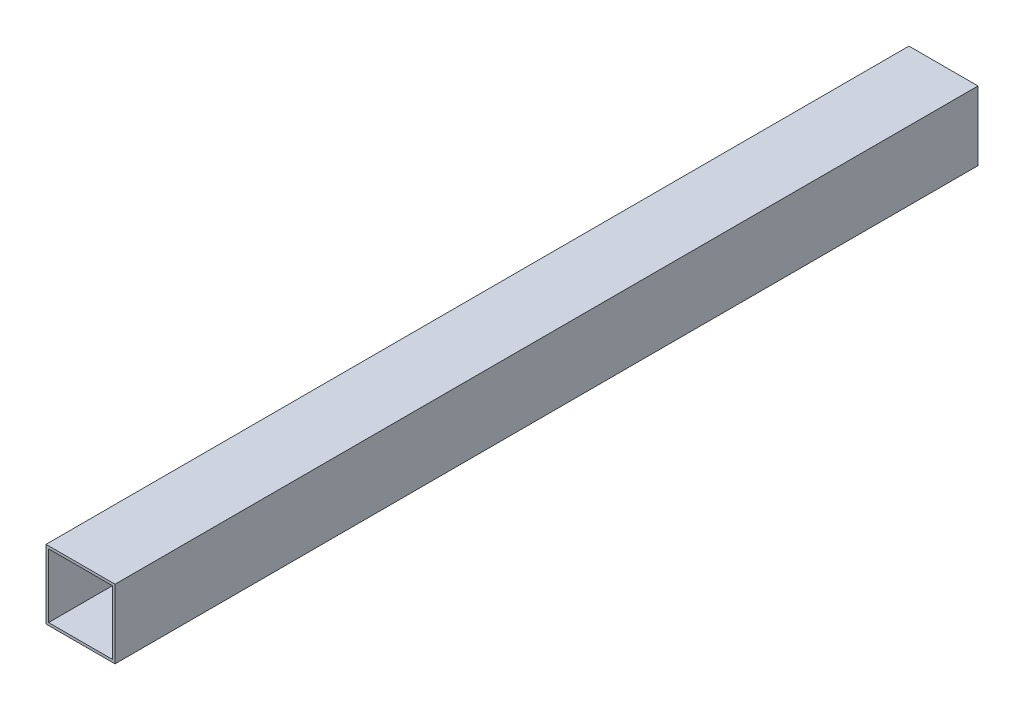
ISO-10303-21;
HEADER;
FILE_DESCRIPTION(('STEP AP214'),'2;1');
FILE_NAME('part.step','',(''),(''),'','','');
FILE_SCHEMA(('AUTOMOTIVE_DESIGN { 1 0 10303 214 1 1 1 1 }'));
ENDSEC;
DATA;
#1=APPLICATION_CONTEXT('core data for automotive mechanical design processes');
#2=APPLICATION_PROTOCOL_DEFINITION('international standard','automotive_design',2000,#1);
#3=PRODUCT_CONTEXT('',#1,'mechanical');
#4=PRODUCT('Part','Part','',(#3));
#5=PRODUCT_RELATED_PRODUCT_CATEGORY('part','',(#4));
#6=PRODUCT_DEFINITION_FORMATION('','',#4);
#7=PRODUCT_DEFINITION_CONTEXT('part definition',#1,'design');
#8=PRODUCT_DEFINITION('design','',#6,#7);
#9=PRODUCT_DEFINITION_SHAPE('','',#8);
#10=(LENGTH_UNIT() NAMED_UNIT(*) SI_UNIT(.MILLI.,.METRE.));
#11=(NAMED_UNIT(*) PLANE_ANGLE_UNIT() SI_UNIT($,.RADIAN.));
#12=(NAMED_UNIT(*) SI_UNIT($,.STERADIAN.) SOLID_ANGLE_UNIT());
#13=UNCERTAINTY_MEASURE_WITH_UNIT(LENGTH_MEASURE(1.E-05),#10,'distance_accuracy_value','');
#14=(GEOMETRIC_REPRESENTATION_CONTEXT(3) GLOBAL_UNCERTAINTY_ASSIGNED_CONTEXT((#13)) GLOBAL_UNIT_ASSIGNED_CONTEXT((#10,
#11,#12)) REPRESENTATION_CONTEXT('',''));
#15=CARTESIAN_POINT('',(0.,0.,0.));
#16=DIRECTION('',(0.,0.,1.));
#17=DIRECTION('',(1.,0.,0.));
#18=AXIS2_PLACEMENT_3D('',#15,#16,#17);
#19=CARTESIAN_POINT('',(0.,0.,500.));
#20=DIRECTION('',(0.,0.,-1.));
#21=DIRECTION('',(-1.,0.,0.));
#22=AXIS2_PLACEMENT_3D('',#19,#20,#21);
#23=PLANE('',#22);
#24=DIRECTION('',(0.,1.,0.));
#25=VECTOR('',#24,1.);
#26=CARTESIAN_POINT('',(20.,-20.,500.));
#27=LINE('',#26,#25);
#28=CARTESIAN_POINT('',(20.,-20.,500.));
#29=VERTEX_POINT('',#28);
#30=CARTESIAN_POINT('',(20.,20.,500.));
#31=VERTEX_POINT('',#30);
#32=EDGE_CURVE('E134',#29,#31,#27,.T.);
#33=ORIENTED_EDGE('',*,*,#32,.T.);
#34=DIRECTION('',(-1.,0.,0.));
#35=VECTOR('',#34,1.);
#36=CARTESIAN_POINT('',(-20.,20.,500.));
#37=LINE('',#36,#35);
#38=CARTESIAN_POINT('',(-20.,20.,500.));
#39=VERTEX_POINT('',#38);
#40=EDGE_CURVE('E137',#31,#39,#37,.T.);
#41=ORIENTED_EDGE('',*,*,#40,.T.);
#42=DIRECTION('',(0.,-1.,0.));
#43=VECTOR('',#42,1.);
#44=CARTESIAN_POINT('',(-20.,-20.,500.));
#45=LINE('',#44,#43);
#46=CARTESIAN_POINT('',(-20.,-20.,500.));
#47=VERTEX_POINT('',#46);
#48=EDGE_CURVE('E140',#39,#47,#45,.T.);
#49=ORIENTED_EDGE('',*,*,#48,.T.);
#50=DIRECTION('',(1.,0.,0.));
#51=VECTOR('',#50,1.);
#52=CARTESIAN_POINT('',(-20.,-20.,500.));
#53=LINE('',#52,#51);
#54=EDGE_CURVE('E142',#47,#29,#53,.T.);
#55=ORIENTED_EDGE('',*,*,#54,.T.);
#56=EDGE_LOOP('',(#33,#41,#49,#55));
#57=FACE_BOUND('',#56,.T.);
#58=DIRECTION('',(0.,1.,0.));
#59=VECTOR('',#58,1.);
#60=CARTESIAN_POINT('',(18.5,-18.5,500.));
#61=LINE('',#60,#59);
#62=CARTESIAN_POINT('',(18.5,-18.5,500.));
#63=VERTEX_POINT('',#62);
#64=CARTESIAN_POINT('',(18.5,18.5,500.));
#65=VERTEX_POINT('',#64);
#66=EDGE_CURVE('E98',#63,#65,#61,.T.);
#67=ORIENTED_EDGE('',*,*,#66,.F.);
#68=DIRECTION('',(1.,0.,0.));
#69=VECTOR('',#68,1.);
#70=CARTESIAN_POINT('',(-18.5,-18.5,500.));
#71=LINE('',#70,#69);
#72=CARTESIAN_POINT('',(-18.5,-18.5,500.));
#73=VERTEX_POINT('',#72);
#74=EDGE_CURVE('E120',#73,#63,#71,.T.);
#75=ORIENTED_EDGE('',*,*,#74,.F.);
#76=DIRECTION('',(0.,-1.,0.));
#77=VECTOR('',#76,1.);
#78=CARTESIAN_POINT('',(-18.5,-18.5,500.));
#79=LINE('',#78,#77);
#80=CARTESIAN_POINT('',(-18.5,18.5,500.));
#81=VERTEX_POINT('',#80);
#82=EDGE_CURVE('E118',#81,#73,#79,.T.);
#83=ORIENTED_EDGE('',*,*,#82,.F.);
#84=DIRECTION('',(-1.,0.,0.));
#85=VECTOR('',#84,1.);
#86=CARTESIAN_POINT('',(-18.5,18.5,500.));
#87=LINE('',#86,#85);
#88=EDGE_CURVE('E106',#65,#81,#87,.T.);
#89=ORIENTED_EDGE('',*,*,#88,.F.);
#90=EDGE_LOOP('',(#67,#75,#83,#89));
#91=FACE_BOUND('',#90,.T.);
#92=ADVANCED_FACE('F33',(#57,#91),#23,.F.);
#93=CARTESIAN_POINT('',(0.,0.,0.));
#94=DIRECTION('',(0.,0.,-1.));
#95=DIRECTION('',(-1.,0.,0.));
#96=AXIS2_PLACEMENT_3D('',#93,#94,#95);
#97=PLANE('',#96);
#98=DIRECTION('',(0.,1.,0.));
#99=VECTOR('',#98,1.);
#100=CARTESIAN_POINT('',(20.,-20.,0.));
#101=LINE('',#100,#99);
#102=CARTESIAN_POINT('',(20.,-20.,0.));
#103=VERTEX_POINT('',#102);
#104=CARTESIAN_POINT('',(20.,20.,0.));
#105=VERTEX_POINT('',#104);
#106=EDGE_CURVE('E114',#103,#105,#101,.T.);
#107=ORIENTED_EDGE('',*,*,#106,.F.);
#108=DIRECTION('',(1.,0.,0.));
#109=VECTOR('',#108,1.);
#110=CARTESIAN_POINT('',(-20.,-20.,0.));
#111=LINE('',#110,#109);
#112=CARTESIAN_POINT('',(-20.,-20.,0.));
#113=VERTEX_POINT('',#112);
#114=EDGE_CURVE('E138',#113,#103,#111,.T.);
#115=ORIENTED_EDGE('',*,*,#114,.F.);
#116=DIRECTION('',(0.,-1.,0.));
#117=VECTOR('',#116,1.);
#118=CARTESIAN_POINT('',(-20.,-20.,0.));
#119=LINE('',#118,#117);
#120=CARTESIAN_POINT('',(-20.,20.,0.));
#121=VERTEX_POINT('',#120);
#122=EDGE_CURVE('E149',#121,#113,#119,.T.);
#123=ORIENTED_EDGE('',*,*,#122,.F.);
#124=DIRECTION('',(-1.,0.,0.));
#125=VECTOR('',#124,1.);
#126=CARTESIAN_POINT('',(-20.,20.,0.));
#127=LINE('',#126,#125);
#128=EDGE_CURVE('E147',#105,#121,#127,.T.);
#129=ORIENTED_EDGE('',*,*,#128,.F.);
#130=EDGE_LOOP('',(#107,#115,#123,#129));
#131=FACE_BOUND('',#130,.T.);
#132=DIRECTION('',(1.,0.,0.));
#133=VECTOR('',#132,1.);
#134=CARTESIAN_POINT('',(-18.5,-18.5,0.));
#135=LINE('',#134,#133);
#136=CARTESIAN_POINT('',(-18.5,-18.5,0.));
#137=VERTEX_POINT('',#136);
#138=CARTESIAN_POINT('',(18.5,-18.5,0.));
#139=VERTEX_POINT('',#138);
#140=EDGE_CURVE('E107',#137,#139,#135,.T.);
#141=ORIENTED_EDGE('',*,*,#140,.T.);
#142=DIRECTION('',(0.,1.,0.));
#143=VECTOR('',#142,1.);
#144=CARTESIAN_POINT('',(18.5,-18.5,0.));
#145=LINE('',#144,#143);
#146=CARTESIAN_POINT('',(18.5,18.5,0.));
#147=VERTEX_POINT('',#146);
#148=EDGE_CURVE('E56',#139,#147,#145,.T.);
#149=ORIENTED_EDGE('',*,*,#148,.T.);
#150=DIRECTION('',(-1.,0.,0.));
#151=VECTOR('',#150,1.);
#152=CARTESIAN_POINT('',(-18.5,18.5,0.));
#153=LINE('',#152,#151);
#154=CARTESIAN_POINT('',(-18.5,18.5,0.));
#155=VERTEX_POINT('',#154);
#156=EDGE_CURVE('E113',#147,#155,#153,.T.);
#157=ORIENTED_EDGE('',*,*,#156,.T.);
#158=DIRECTION('',(0.,-1.,0.));
#159=VECTOR('',#158,1.);
#160=CARTESIAN_POINT('',(-18.5,-18.5,0.));
#161=LINE('',#160,#159);
#162=EDGE_CURVE('E126',#155,#137,#161,.T.);
#163=ORIENTED_EDGE('',*,*,#162,.T.);
#164=EDGE_LOOP('',(#141,#149,#157,#163));
#165=FACE_BOUND('',#164,.T.);
#166=ADVANCED_FACE('F167',(#131,#165),#97,.T.);
#167=CARTESIAN_POINT('',(20.,-20.,500.));
#168=DIRECTION('',(-1.,0.,0.));
#169=DIRECTION('',(0.,0.,1.));
#170=AXIS2_PLACEMENT_3D('',#167,#168,#169);
#171=PLANE('',#170);
#172=ORIENTED_EDGE('',*,*,#106,.T.);
#173=DIRECTION('',(0.,0.,-1.));
#174=VECTOR('',#173,1.);
#175=CARTESIAN_POINT('',(20.,20.,500.));
#176=LINE('',#175,#174);
#177=EDGE_CURVE('E11',#31,#105,#176,.T.);
#178=ORIENTED_EDGE('',*,*,#177,.F.);
#179=ORIENTED_EDGE('',*,*,#32,.F.);
#180=DIRECTION('',(0.,0.,-1.));
#181=VECTOR('',#180,1.);
#182=CARTESIAN_POINT('',(20.,-20.,500.));
#183=LINE('',#182,#181);
#184=EDGE_CURVE('E144',#29,#103,#183,.T.);
#185=ORIENTED_EDGE('',*,*,#184,.T.);
#186=EDGE_LOOP('',(#172,#178,#179,#185));
#187=FACE_BOUND('',#186,.T.);
#188=ADVANCED_FACE('F35',(#187),#171,.F.);
#189=CARTESIAN_POINT('',(-20.,20.,500.));
#190=DIRECTION('',(0.,-1.,0.));
#191=DIRECTION('',(0.,0.,-1.));
#192=AXIS2_PLACEMENT_3D('',#189,#190,#191);
#193=PLANE('',#192);
#194=ORIENTED_EDGE('',*,*,#128,.T.);
#195=DIRECTION('',(0.,0.,-1.));
#196=VECTOR('',#195,1.);
#197=CARTESIAN_POINT('',(-20.,20.,500.));
#198=LINE('',#197,#196);
#199=EDGE_CURVE('E41',#39,#121,#198,.T.);
#200=ORIENTED_EDGE('',*,*,#199,.F.);
#201=ORIENTED_EDGE('',*,*,#40,.F.);
#202=ORIENTED_EDGE('',*,*,#177,.T.);
#203=EDGE_LOOP('',(#194,#200,#201,#202));
#204=FACE_BOUND('',#203,.T.);
#205=ADVANCED_FACE('F177',(#204),#193,.F.);
#206=CARTESIAN_POINT('',(-20.,-20.,500.));
#207=DIRECTION('',(1.,0.,0.));
#208=DIRECTION('',(0.,0.,-1.));
#209=AXIS2_PLACEMENT_3D('',#206,#207,#208);
#210=PLANE('',#209);
#211=ORIENTED_EDGE('',*,*,#122,.T.);
#212=DIRECTION('',(0.,0.,-1.));
#213=VECTOR('',#212,1.);
#214=CARTESIAN_POINT('',(-20.,-20.,500.));
#215=LINE('',#214,#213);
#216=EDGE_CURVE('E154',#47,#113,#215,.T.);
#217=ORIENTED_EDGE('',*,*,#216,.F.);
#218=ORIENTED_EDGE('',*,*,#48,.F.);
#219=ORIENTED_EDGE('',*,*,#199,.T.);
#220=EDGE_LOOP('',(#211,#217,#218,#219));
#221=FACE_BOUND('',#220,.T.);
#222=ADVANCED_FACE('F161',(#221),#210,.F.);
#223=CARTESIAN_POINT('',(-20.,-20.,500.));
#224=DIRECTION('',(0.,1.,0.));
#225=DIRECTION('',(0.,0.,1.));
#226=AXIS2_PLACEMENT_3D('',#223,#224,#225);
#227=PLANE('',#226);
#228=ORIENTED_EDGE('',*,*,#114,.T.);
#229=ORIENTED_EDGE('',*,*,#184,.F.);
#230=ORIENTED_EDGE('',*,*,#54,.F.);
#231=ORIENTED_EDGE('',*,*,#216,.T.);
#232=EDGE_LOOP('',(#228,#229,#230,#231));
#233=FACE_BOUND('',#232,.T.);
#234=ADVANCED_FACE('F171',(#233),#227,.F.);
#235=CARTESIAN_POINT('',(18.5,-18.5,500.));
#236=DIRECTION('',(-1.,0.,0.));
#237=DIRECTION('',(0.,0.,1.));
#238=AXIS2_PLACEMENT_3D('',#235,#236,#237);
#239=PLANE('',#238);
#240=ORIENTED_EDGE('',*,*,#148,.F.);
#241=DIRECTION('',(0.,0.,-1.));
#242=VECTOR('',#241,1.);
#243=CARTESIAN_POINT('',(18.5,-18.5,500.));
#244=LINE('',#243,#242);
#245=EDGE_CURVE('E102',#63,#139,#244,.T.);
#246=ORIENTED_EDGE('',*,*,#245,.F.);
#247=ORIENTED_EDGE('',*,*,#66,.T.);
#248=DIRECTION('',(0.,0.,-1.));
#249=VECTOR('',#248,1.);
#250=CARTESIAN_POINT('',(18.5,18.5,500.));
#251=LINE('',#250,#249);
#252=EDGE_CURVE('E101',#65,#147,#251,.T.);
#253=ORIENTED_EDGE('',*,*,#252,.T.);
#254=EDGE_LOOP('',(#240,#246,#247,#253));
#255=FACE_BOUND('',#254,.T.);
#256=ADVANCED_FACE('F100',(#255),#239,.T.);
#257=CARTESIAN_POINT('',(-18.5,18.5,500.));
#258=DIRECTION('',(0.,-1.,0.));
#259=DIRECTION('',(0.,0.,-1.));
#260=AXIS2_PLACEMENT_3D('',#257,#258,#259);
#261=PLANE('',#260);
#262=ORIENTED_EDGE('',*,*,#156,.F.);
#263=ORIENTED_EDGE('',*,*,#252,.F.);
#264=ORIENTED_EDGE('',*,*,#88,.T.);
#265=DIRECTION('',(0.,0.,-1.));
#266=VECTOR('',#265,1.);
#267=CARTESIAN_POINT('',(-18.5,18.5,500.));
#268=LINE('',#267,#266);
#269=EDGE_CURVE('E115',#81,#155,#268,.T.);
#270=ORIENTED_EDGE('',*,*,#269,.T.);
#271=EDGE_LOOP('',(#262,#263,#264,#270));
#272=FACE_BOUND('',#271,.T.);
#273=ADVANCED_FACE('F110',(#272),#261,.T.);
#274=CARTESIAN_POINT('',(-18.5,-18.5,500.));
#275=DIRECTION('',(1.,0.,0.));
#276=DIRECTION('',(0.,0.,-1.));
#277=AXIS2_PLACEMENT_3D('',#274,#275,#276);
#278=PLANE('',#277);
#279=ORIENTED_EDGE('',*,*,#162,.F.);
#280=ORIENTED_EDGE('',*,*,#269,.F.);
#281=ORIENTED_EDGE('',*,*,#82,.T.);
#282=DIRECTION('',(0.,0.,-1.));
#283=VECTOR('',#282,1.);
#284=CARTESIAN_POINT('',(-18.5,-18.5,500.));
#285=LINE('',#284,#283);
#286=EDGE_CURVE('E48',#73,#137,#285,.T.);
#287=ORIENTED_EDGE('',*,*,#286,.T.);
#288=EDGE_LOOP('',(#279,#280,#281,#287));
#289=FACE_BOUND('',#288,.T.);
#290=ADVANCED_FACE('F200',(#289),#278,.T.);
#291=CARTESIAN_POINT('',(-18.5,-18.5,500.));
#292=DIRECTION('',(0.,1.,0.));
#293=DIRECTION('',(0.,0.,1.));
#294=AXIS2_PLACEMENT_3D('',#291,#292,#293);
#295=PLANE('',#294);
#296=ORIENTED_EDGE('',*,*,#140,.F.);
#297=ORIENTED_EDGE('',*,*,#286,.F.);
#298=ORIENTED_EDGE('',*,*,#74,.T.);
#299=ORIENTED_EDGE('',*,*,#245,.T.);
#300=EDGE_LOOP('',(#296,#297,#298,#299));
#301=FACE_BOUND('',#300,.T.);
#302=ADVANCED_FACE('F204',(#301),#295,.T.);
#303=CLOSED_SHELL('',(#92,#166,#188,#205,#222,#234,#256,#273,#290,#302));
#304=MANIFOLD_SOLID_BREP('B2',#303);
#305=ADVANCED_BREP_SHAPE_REPRESENTATION('',(#18,#304),#14);
#306=SHAPE_DEFINITION_REPRESENTATION(#9,#305);
ENDSEC;
END-ISO-10303-21;
